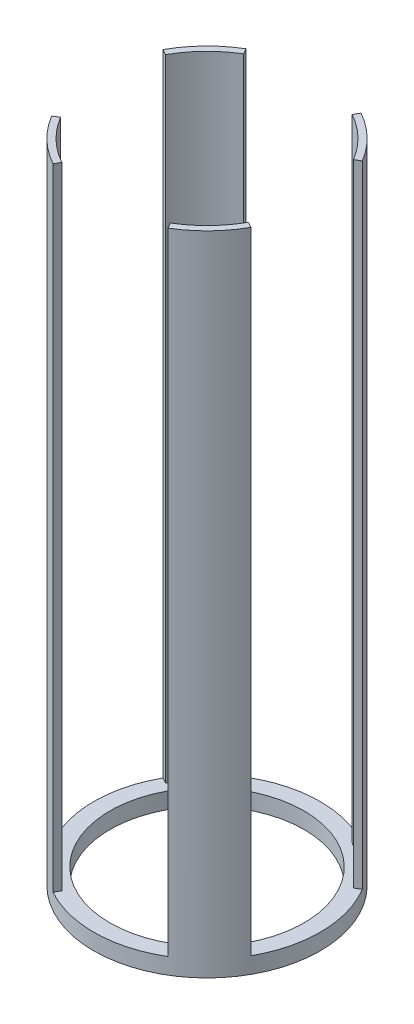
ISO-10303-21;
HEADER;
FILE_DESCRIPTION(('STEP AP214'),'2;1');
FILE_NAME('part.step','',(''),(''),'','','');
FILE_SCHEMA(('AUTOMOTIVE_DESIGN { 1 0 10303 214 1 1 1 1 }'));
ENDSEC;
DATA;
#1=APPLICATION_CONTEXT('core data for automotive mechanical design processes');
#2=APPLICATION_PROTOCOL_DEFINITION('international standard','automotive_design',2000,#1);
#3=PRODUCT_CONTEXT('',#1,'mechanical');
#4=PRODUCT('Part','Part','',(#3));
#5=PRODUCT_RELATED_PRODUCT_CATEGORY('part','',(#4));
#6=PRODUCT_DEFINITION_FORMATION('','',#4);
#7=PRODUCT_DEFINITION_CONTEXT('part definition',#1,'design');
#8=PRODUCT_DEFINITION('design','',#6,#7);
#9=PRODUCT_DEFINITION_SHAPE('','',#8);
#10=(LENGTH_UNIT() NAMED_UNIT(*) SI_UNIT(.MILLI.,.METRE.));
#11=(NAMED_UNIT(*) PLANE_ANGLE_UNIT() SI_UNIT($,.RADIAN.));
#12=(NAMED_UNIT(*) SI_UNIT($,.STERADIAN.) SOLID_ANGLE_UNIT());
#13=UNCERTAINTY_MEASURE_WITH_UNIT(LENGTH_MEASURE(1.E-05),#10,'distance_accuracy_value','');
#14=(GEOMETRIC_REPRESENTATION_CONTEXT(3) GLOBAL_UNCERTAINTY_ASSIGNED_CONTEXT((#13)) GLOBAL_UNIT_ASSIGNED_CONTEXT((#10,
#11,#12)) REPRESENTATION_CONTEXT('',''));
#15=CARTESIAN_POINT('',(0.,0.,0.));
#16=DIRECTION('',(0.,0.,1.));
#17=DIRECTION('',(1.,0.,0.));
#18=AXIS2_PLACEMENT_3D('',#15,#16,#17);
#19=CARTESIAN_POINT('',(0.,-241.3,0.));
#20=DIRECTION('',(0.,-1.,0.));
#21=DIRECTION('',(0.,0.,-1.));
#22=AXIS2_PLACEMENT_3D('',#19,#20,#21);
#23=PLANE('',#22);
#24=CARTESIAN_POINT('',(0.,-241.3,0.));
#25=DIRECTION('',(0.,-1.,0.));
#26=DIRECTION('',(0.,0.,-1.));
#27=AXIS2_PLACEMENT_3D('',#24,#25,#26);
#28=CIRCLE('',#27,76.2);
#29=CARTESIAN_POINT('',(0.,-241.3,-76.2));
#30=VERTEX_POINT('',#29);
#31=EDGE_CURVE('E415',#30,#30,#28,.T.);
#32=ORIENTED_EDGE('',*,*,#31,.T.);
#33=EDGE_LOOP('',(#32));
#34=FACE_BOUND('',#33,.T.);
#35=CARTESIAN_POINT('',(0.,-241.3,0.));
#36=DIRECTION('',(0.,-1.,0.));
#37=DIRECTION('',(0.,0.,-1.));
#38=AXIS2_PLACEMENT_3D('',#35,#36,#37);
#39=CIRCLE('',#38,83.82);
#40=CARTESIAN_POINT('',(43.0878052929432,-241.3,71.8973812808048));
#41=VERTEX_POINT('',#40);
#42=CARTESIAN_POINT('',(73.2638246174091,-241.3,40.7210560082805));
#43=VERTEX_POINT('',#42);
#44=EDGE_CURVE('E364',#41,#43,#39,.F.);
#45=ORIENTED_EDGE('',*,*,#44,.T.);
#46=DIRECTION('',(0.87406137696742,0.,0.485815509523748));
#47=VECTOR('',#46,1.);
#48=CARTESIAN_POINT('',(0.,-241.3,0.));
#49=LINE('',#48,#47);
#50=CARTESIAN_POINT('',(77.7040564124036,-241.3,43.1889987966612));
#51=VERTEX_POINT('',#50);
#52=EDGE_CURVE('E361',#43,#51,#49,.T.);
#53=ORIENTED_EDGE('',*,*,#52,.T.);
#54=CARTESIAN_POINT('',(0.,-241.3,0.));
#55=DIRECTION('',(0.,-1.,0.));
#56=DIRECTION('',(0.,0.,-1.));
#57=AXIS2_PLACEMENT_3D('',#54,#55,#56);
#58=CIRCLE('',#57,88.9);
#59=CARTESIAN_POINT('',(76.2547983281261,-241.3,-45.6991874319097));
#60=VERTEX_POINT('',#59);
#61=EDGE_CURVE('E491',#60,#51,#58,.T.);
#62=ORIENTED_EDGE('',*,*,#61,.F.);
#63=DIRECTION('',(-0.857759261283759,0.,0.514051602158714));
#64=VECTOR('',#63,1.);
#65=CARTESIAN_POINT('',(0.,-241.3,0.));
#66=LINE('',#65,#64);
#67=CARTESIAN_POINT('',(71.8973812808046,-241.3,-43.0878052929434));
#68=VERTEX_POINT('',#67);
#69=EDGE_CURVE('E241',#60,#68,#66,.T.);
#70=ORIENTED_EDGE('',*,*,#69,.T.);
#71=CARTESIAN_POINT('',(0.,-241.3,0.));
#72=DIRECTION('',(0.,-1.,0.));
#73=DIRECTION('',(0.,0.,-1.));
#74=AXIS2_PLACEMENT_3D('',#71,#72,#73);
#75=CIRCLE('',#74,83.82);
#76=CARTESIAN_POINT('',(40.7210560082808,-241.3,-73.2638246174089));
#77=VERTEX_POINT('',#76);
#78=EDGE_CURVE('E391',#68,#77,#75,.F.);
#79=ORIENTED_EDGE('',*,*,#78,.T.);
#80=DIRECTION('',(-0.485815509523751,0.,0.874061376967418));
#81=VECTOR('',#80,1.);
#82=CARTESIAN_POINT('',(0.,-241.3,0.));
#83=LINE('',#82,#81);
#84=CARTESIAN_POINT('',(43.1889987966615,-241.3,-77.7040564124034));
#85=VERTEX_POINT('',#84);
#86=EDGE_CURVE('E383',#85,#77,#83,.T.);
#87=ORIENTED_EDGE('',*,*,#86,.F.);
#88=CARTESIAN_POINT('',(-45.6991874319094,-241.3,-76.2547983281263));
#89=VERTEX_POINT('',#88);
#90=EDGE_CURVE('E425',#89,#85,#58,.T.);
#91=ORIENTED_EDGE('',*,*,#90,.F.);
#92=DIRECTION('',(-0.514051602158711,0.,-0.85775926128376));
#93=VECTOR('',#92,1.);
#94=CARTESIAN_POINT('',(0.,-241.3,0.));
#95=LINE('',#94,#93);
#96=CARTESIAN_POINT('',(-43.0878052929431,-241.3,-71.8973812808048));
#97=VERTEX_POINT('',#96);
#98=EDGE_CURVE('E12',#97,#89,#95,.T.);
#99=ORIENTED_EDGE('',*,*,#98,.F.);
#100=CARTESIAN_POINT('',(0.,-241.3,0.));
#101=DIRECTION('',(0.,-1.,0.));
#102=DIRECTION('',(0.,0.,-1.));
#103=AXIS2_PLACEMENT_3D('',#100,#101,#102);
#104=CIRCLE('',#103,83.82);
#105=CARTESIAN_POINT('',(-73.2638246174091,-241.3,-40.7210560082805));
#106=VERTEX_POINT('',#105);
#107=EDGE_CURVE('E226',#97,#106,#104,.F.);
#108=ORIENTED_EDGE('',*,*,#107,.T.);
#109=DIRECTION('',(0.87406137696742,0.,0.485815509523748));
#110=VECTOR('',#109,1.);
#111=CARTESIAN_POINT('',(0.,-241.3,0.));
#112=LINE('',#111,#110);
#113=CARTESIAN_POINT('',(-77.7040564124036,-241.3,-43.1889987966612));
#114=VERTEX_POINT('',#113);
#115=EDGE_CURVE('E458',#114,#106,#112,.T.);
#116=ORIENTED_EDGE('',*,*,#115,.F.);
#117=CARTESIAN_POINT('',(-76.2547983281261,-241.3,45.6991874319097));
#118=VERTEX_POINT('',#117);
#119=EDGE_CURVE('E421',#118,#114,#58,.T.);
#120=ORIENTED_EDGE('',*,*,#119,.F.);
#121=DIRECTION('',(0.857759261283758,0.,-0.514051602158714));
#122=VECTOR('',#121,1.);
#123=CARTESIAN_POINT('',(0.,-241.3,0.));
#124=LINE('',#123,#122);
#125=CARTESIAN_POINT('',(-71.8973812808046,-241.3,43.0878052929434));
#126=VERTEX_POINT('',#125);
#127=EDGE_CURVE('E427',#118,#126,#124,.T.);
#128=ORIENTED_EDGE('',*,*,#127,.T.);
#129=CARTESIAN_POINT('',(0.,-241.3,0.));
#130=DIRECTION('',(0.,-1.,0.));
#131=DIRECTION('',(0.,0.,-1.));
#132=AXIS2_PLACEMENT_3D('',#129,#130,#131);
#133=CIRCLE('',#132,83.82);
#134=CARTESIAN_POINT('',(-40.7210560082808,-241.3,73.263824617409));
#135=VERTEX_POINT('',#134);
#136=EDGE_CURVE('E424',#135,#126,#133,.T.);
#137=ORIENTED_EDGE('',*,*,#136,.F.);
#138=DIRECTION('',(0.48581550952375,0.,-0.874061376967418));
#139=VECTOR('',#138,1.);
#140=CARTESIAN_POINT('',(0.,-241.3,0.));
#141=LINE('',#140,#139);
#142=CARTESIAN_POINT('',(-43.1889987966614,-241.3,77.7040564124034));
#143=VERTEX_POINT('',#142);
#144=EDGE_CURVE('E448',#143,#135,#141,.T.);
#145=ORIENTED_EDGE('',*,*,#144,.F.);
#146=CARTESIAN_POINT('',(45.6991874319094,-241.3,76.2547983281263));
#147=VERTEX_POINT('',#146);
#148=EDGE_CURVE('E418',#147,#143,#58,.T.);
#149=ORIENTED_EDGE('',*,*,#148,.F.);
#150=DIRECTION('',(-0.514051602158711,0.,-0.85775926128376));
#151=VECTOR('',#150,1.);
#152=CARTESIAN_POINT('',(0.,-241.3,0.));
#153=LINE('',#152,#151);
#154=EDGE_CURVE('E335',#147,#41,#153,.T.);
#155=ORIENTED_EDGE('',*,*,#154,.T.);
#156=EDGE_LOOP('',(#45,#53,#62,#70,#79,#87,#91,#99,#108,#116,#120,#128,#137,#145,#149,#155));
#157=FACE_BOUND('',#156,.T.);
#158=ADVANCED_FACE('F218',(#34,#157),#23,.F.);
#159=CARTESIAN_POINT('',(0.,254.,0.));
#160=DIRECTION('',(0.,-1.,0.));
#161=DIRECTION('',(0.,0.,-1.));
#162=AXIS2_PLACEMENT_3D('',#159,#160,#161);
#163=CYLINDRICAL_SURFACE('',#162,83.82);
#164=DIRECTION('',(0.,-1.,0.));
#165=VECTOR('',#164,1.);
#166=CARTESIAN_POINT('',(-40.7210560082808,254.,73.263824617409));
#167=LINE('',#166,#165);
#168=CARTESIAN_POINT('',(-40.7210560082808,254.,73.263824617409));
#169=VERTEX_POINT('',#168);
#170=EDGE_CURVE('E431',#169,#135,#167,.T.);
#171=ORIENTED_EDGE('',*,*,#170,.T.);
#172=ORIENTED_EDGE('',*,*,#136,.T.);
#173=DIRECTION('',(0.,-1.,0.));
#174=VECTOR('',#173,1.);
#175=CARTESIAN_POINT('',(-71.8973812808046,254.,43.0878052929434));
#176=LINE('',#175,#174);
#177=CARTESIAN_POINT('',(-71.8973812808046,254.,43.0878052929434));
#178=VERTEX_POINT('',#177);
#179=EDGE_CURVE('E434',#178,#126,#176,.T.);
#180=ORIENTED_EDGE('',*,*,#179,.F.);
#181=CARTESIAN_POINT('',(0.,254.,0.));
#182=DIRECTION('',(0.,1.,0.));
#183=DIRECTION('',(0.,0.,1.));
#184=AXIS2_PLACEMENT_3D('',#181,#182,#183);
#185=CIRCLE('',#184,83.82);
#186=EDGE_CURVE('E435',#178,#169,#185,.T.);
#187=ORIENTED_EDGE('',*,*,#186,.T.);
#188=EDGE_LOOP('',(#171,#172,#180,#187));
#189=FACE_BOUND('',#188,.T.);
#190=ADVANCED_FACE('F485',(#189),#163,.F.);
#191=CARTESIAN_POINT('',(0.,-254.,0.));
#192=DIRECTION('',(0.514051602158714,0.,0.857759261283758));
#193=DIRECTION('',(0.857759261283758,0.,-0.514051602158714));
#194=AXIS2_PLACEMENT_3D('',#191,#192,#193);
#195=PLANE('',#194);
#196=ORIENTED_EDGE('',*,*,#127,.F.);
#197=DIRECTION('',(0.,-1.,0.));
#198=VECTOR('',#197,1.);
#199=CARTESIAN_POINT('',(-76.2547983281261,254.,45.6991874319097));
#200=LINE('',#199,#198);
#201=CARTESIAN_POINT('',(-76.2547983281261,254.,45.6991874319097));
#202=VERTEX_POINT('',#201);
#203=EDGE_CURVE('E441',#202,#118,#200,.T.);
#204=ORIENTED_EDGE('',*,*,#203,.F.);
#205=DIRECTION('',(0.857759261283758,0.,-0.514051602158714));
#206=VECTOR('',#205,1.);
#207=CARTESIAN_POINT('',(0.,254.,0.));
#208=LINE('',#207,#206);
#209=EDGE_CURVE('E436',#202,#178,#208,.T.);
#210=ORIENTED_EDGE('',*,*,#209,.T.);
#211=ORIENTED_EDGE('',*,*,#179,.T.);
#212=EDGE_LOOP('',(#196,#204,#210,#211));
#213=FACE_BOUND('',#212,.T.);
#214=ADVANCED_FACE('F480',(#213),#195,.F.);
#215=CARTESIAN_POINT('',(0.,-254.,0.));
#216=DIRECTION('',(0.874061376967418,0.,0.48581550952375));
#217=DIRECTION('',(0.48581550952375,0.,-0.874061376967418));
#218=AXIS2_PLACEMENT_3D('',#215,#216,#217);
#219=PLANE('',#218);
#220=DIRECTION('',(0.,-1.,0.));
#221=VECTOR('',#220,1.);
#222=CARTESIAN_POINT('',(-43.1889987966614,254.,77.7040564124034));
#223=LINE('',#222,#221);
#224=CARTESIAN_POINT('',(-43.1889987966614,254.,77.7040564124034));
#225=VERTEX_POINT('',#224);
#226=EDGE_CURVE('E438',#225,#143,#223,.T.);
#227=ORIENTED_EDGE('',*,*,#226,.T.);
#228=ORIENTED_EDGE('',*,*,#144,.T.);
#229=ORIENTED_EDGE('',*,*,#170,.F.);
#230=DIRECTION('',(0.48581550952375,0.,-0.874061376967418));
#231=VECTOR('',#230,1.);
#232=CARTESIAN_POINT('',(0.,254.,0.));
#233=LINE('',#232,#231);
#234=EDGE_CURVE('E445',#225,#169,#233,.T.);
#235=ORIENTED_EDGE('',*,*,#234,.F.);
#236=EDGE_LOOP('',(#227,#228,#229,#235));
#237=FACE_BOUND('',#236,.T.);
#238=ADVANCED_FACE('F490',(#237),#219,.T.);
#239=CARTESIAN_POINT('',(0.,-254.,0.));
#240=DIRECTION('',(0.,1.,0.));
#241=DIRECTION('',(0.,0.,1.));
#242=AXIS2_PLACEMENT_3D('',#239,#240,#241);
#243=PLANE('',#242);
#244=CARTESIAN_POINT('',(0.,-254.,0.));
#245=DIRECTION('',(0.,1.,0.));
#246=DIRECTION('',(0.,0.,1.));
#247=AXIS2_PLACEMENT_3D('',#244,#245,#246);
#248=CIRCLE('',#247,88.9);
#249=CARTESIAN_POINT('',(0.,-254.,88.9));
#250=VERTEX_POINT('',#249);
#251=EDGE_CURVE('E444',#250,#250,#248,.T.);
#252=ORIENTED_EDGE('',*,*,#251,.F.);
#253=EDGE_LOOP('',(#252));
#254=FACE_BOUND('',#253,.T.);
#255=CARTESIAN_POINT('',(0.,-254.,0.));
#256=DIRECTION('',(0.,-1.,0.));
#257=DIRECTION('',(0.,0.,-1.));
#258=AXIS2_PLACEMENT_3D('',#255,#256,#257);
#259=CIRCLE('',#258,76.2);
#260=CARTESIAN_POINT('',(0.,-254.,-76.2));
#261=VERTEX_POINT('',#260);
#262=EDGE_CURVE('E397',#261,#261,#259,.T.);
#263=ORIENTED_EDGE('',*,*,#262,.F.);
#264=EDGE_LOOP('',(#263));
#265=FACE_BOUND('',#264,.T.);
#266=ADVANCED_FACE('F220',(#254,#265),#243,.F.);
#267=CARTESIAN_POINT('',(0.,254.,0.));
#268=DIRECTION('',(0.,1.,0.));
#269=DIRECTION('',(0.,0.,1.));
#270=AXIS2_PLACEMENT_3D('',#267,#268,#269);
#271=PLANE('',#270);
#272=CARTESIAN_POINT('',(0.,254.,0.));
#273=DIRECTION('',(0.,1.,0.));
#274=DIRECTION('',(0.,0.,1.));
#275=AXIS2_PLACEMENT_3D('',#272,#273,#274);
#276=CIRCLE('',#275,88.9);
#277=EDGE_CURVE('E430',#202,#225,#276,.T.);
#278=ORIENTED_EDGE('',*,*,#277,.T.);
#279=ORIENTED_EDGE('',*,*,#234,.T.);
#280=ORIENTED_EDGE('',*,*,#186,.F.);
#281=ORIENTED_EDGE('',*,*,#209,.F.);
#282=EDGE_LOOP('',(#278,#279,#280,#281));
#283=FACE_BOUND('',#282,.T.);
#284=ADVANCED_FACE('F487',(#283),#271,.T.);
#285=CARTESIAN_POINT('',(0.,254.,0.));
#286=DIRECTION('',(0.,-1.,0.));
#287=DIRECTION('',(0.,0.,-1.));
#288=AXIS2_PLACEMENT_3D('',#285,#286,#287);
#289=CYLINDRICAL_SURFACE('',#288,88.9);
#290=ORIENTED_EDGE('',*,*,#251,.T.);
#291=EDGE_LOOP('',(#290));
#292=FACE_BOUND('',#291,.T.);
#293=ORIENTED_EDGE('',*,*,#61,.T.);
#294=DIRECTION('',(0.,-1.,0.));
#295=VECTOR('',#294,1.);
#296=CARTESIAN_POINT('',(77.7040564124036,254.,43.1889987966612));
#297=LINE('',#296,#295);
#298=CARTESIAN_POINT('',(77.7040564124036,254.,43.1889987966612));
#299=VERTEX_POINT('',#298);
#300=EDGE_CURVE('E351',#299,#51,#297,.T.);
#301=ORIENTED_EDGE('',*,*,#300,.F.);
#302=CARTESIAN_POINT('',(0.,254.,0.));
#303=DIRECTION('',(0.,1.,0.));
#304=DIRECTION('',(0.,0.,1.));
#305=AXIS2_PLACEMENT_3D('',#302,#303,#304);
#306=CIRCLE('',#305,88.9);
#307=CARTESIAN_POINT('',(45.6991874319095,254.,76.2547983281263));
#308=VERTEX_POINT('',#307);
#309=EDGE_CURVE('E344',#308,#299,#306,.T.);
#310=ORIENTED_EDGE('',*,*,#309,.F.);
#311=DIRECTION('',(0.,-1.,0.));
#312=VECTOR('',#311,1.);
#313=CARTESIAN_POINT('',(45.6991874319094,254.,76.2547983281263));
#314=LINE('',#313,#312);
#315=EDGE_CURVE('E329',#147,#308,#314,.F.);
#316=ORIENTED_EDGE('',*,*,#315,.F.);
#317=ORIENTED_EDGE('',*,*,#148,.T.);
#318=ORIENTED_EDGE('',*,*,#226,.F.);
#319=ORIENTED_EDGE('',*,*,#277,.F.);
#320=ORIENTED_EDGE('',*,*,#203,.T.);
#321=ORIENTED_EDGE('',*,*,#119,.T.);
#322=DIRECTION('',(0.,-1.,0.));
#323=VECTOR('',#322,1.);
#324=CARTESIAN_POINT('',(-77.7040564124036,254.,-43.1889987966611));
#325=LINE('',#324,#323);
#326=CARTESIAN_POINT('',(-77.7040564124036,254.,-43.1889987966612));
#327=VERTEX_POINT('',#326);
#328=EDGE_CURVE('E407',#114,#327,#325,.F.);
#329=ORIENTED_EDGE('',*,*,#328,.T.);
#330=CARTESIAN_POINT('',(0.,254.,0.));
#331=DIRECTION('',(0.,1.,0.));
#332=DIRECTION('',(0.,0.,1.));
#333=AXIS2_PLACEMENT_3D('',#330,#331,#332);
#334=CIRCLE('',#333,88.9);
#335=CARTESIAN_POINT('',(-45.6991874319094,254.,-76.2547983281263));
#336=VERTEX_POINT('',#335);
#337=EDGE_CURVE('E406',#336,#327,#334,.T.);
#338=ORIENTED_EDGE('',*,*,#337,.F.);
#339=DIRECTION('',(0.,-1.,0.));
#340=VECTOR('',#339,1.);
#341=CARTESIAN_POINT('',(-45.6991874319094,254.,-76.2547983281263));
#342=LINE('',#341,#340);
#343=EDGE_CURVE('E403',#336,#89,#342,.T.);
#344=ORIENTED_EDGE('',*,*,#343,.T.);
#345=ORIENTED_EDGE('',*,*,#90,.T.);
#346=DIRECTION('',(0.,-1.,0.));
#347=VECTOR('',#346,1.);
#348=CARTESIAN_POINT('',(43.1889987966614,254.,-77.7040564124034));
#349=LINE('',#348,#347);
#350=CARTESIAN_POINT('',(43.1889987966614,254.,-77.7040564124034));
#351=VERTEX_POINT('',#350);
#352=EDGE_CURVE('E375',#85,#351,#349,.F.);
#353=ORIENTED_EDGE('',*,*,#352,.T.);
#354=CARTESIAN_POINT('',(0.,254.,0.));
#355=DIRECTION('',(0.,1.,0.));
#356=DIRECTION('',(0.,0.,1.));
#357=AXIS2_PLACEMENT_3D('',#354,#355,#356);
#358=CIRCLE('',#357,88.9);
#359=CARTESIAN_POINT('',(76.2547983281261,254.,-45.6991874319097));
#360=VERTEX_POINT('',#359);
#361=EDGE_CURVE('E379',#360,#351,#358,.T.);
#362=ORIENTED_EDGE('',*,*,#361,.F.);
#363=DIRECTION('',(0.,-1.,0.));
#364=VECTOR('',#363,1.);
#365=CARTESIAN_POINT('',(76.2547983281261,254.,-45.6991874319097));
#366=LINE('',#365,#364);
#367=EDGE_CURVE('E371',#60,#360,#366,.F.);
#368=ORIENTED_EDGE('',*,*,#367,.F.);
#369=EDGE_LOOP('',(#293,#301,#310,#316,#317,#318,#319,#320,#321,#329,#338,#344,#345,#353,#362,#368));
#370=FACE_BOUND('',#369,.T.);
#371=ADVANCED_FACE('F350',(#292,#370),#289,.T.);
#372=CARTESIAN_POINT('',(0.,-241.3,0.));
#373=DIRECTION('',(0.,-1.,0.));
#374=DIRECTION('',(0.,0.,-1.));
#375=AXIS2_PLACEMENT_3D('',#372,#373,#374);
#376=CYLINDRICAL_SURFACE('',#375,76.2);
#377=ORIENTED_EDGE('',*,*,#31,.F.);
#378=EDGE_LOOP('',(#377));
#379=FACE_BOUND('',#378,.T.);
#380=ORIENTED_EDGE('',*,*,#262,.T.);
#381=EDGE_LOOP('',(#380));
#382=FACE_BOUND('',#381,.T.);
#383=ADVANCED_FACE('F527',(#379,#382),#376,.F.);
#384=CARTESIAN_POINT('',(0.,254.,0.));
#385=DIRECTION('',(0.,-1.,0.));
#386=DIRECTION('',(0.,0.,-1.));
#387=AXIS2_PLACEMENT_3D('',#384,#385,#386);
#388=CYLINDRICAL_SURFACE('',#387,83.82);
#389=ORIENTED_EDGE('',*,*,#107,.F.);
#390=DIRECTION('',(0.,-1.,0.));
#391=VECTOR('',#390,1.);
#392=CARTESIAN_POINT('',(-43.0878052929431,254.,-71.8973812808048));
#393=LINE('',#392,#391);
#394=CARTESIAN_POINT('',(-43.0878052929431,254.,-71.8973812808048));
#395=VERTEX_POINT('',#394);
#396=EDGE_CURVE('E399',#395,#97,#393,.T.);
#397=ORIENTED_EDGE('',*,*,#396,.F.);
#398=CARTESIAN_POINT('',(0.,254.,0.));
#399=DIRECTION('',(0.,1.,0.));
#400=DIRECTION('',(0.,0.,1.));
#401=AXIS2_PLACEMENT_3D('',#398,#399,#400);
#402=CIRCLE('',#401,83.82);
#403=CARTESIAN_POINT('',(-73.2638246174091,254.,-40.7210560082805));
#404=VERTEX_POINT('',#403);
#405=EDGE_CURVE('E393',#395,#404,#402,.T.);
#406=ORIENTED_EDGE('',*,*,#405,.T.);
#407=DIRECTION('',(0.,-1.,0.));
#408=VECTOR('',#407,1.);
#409=CARTESIAN_POINT('',(-73.2638246174091,254.,-40.7210560082805));
#410=LINE('',#409,#408);
#411=EDGE_CURVE('E398',#106,#404,#410,.F.);
#412=ORIENTED_EDGE('',*,*,#411,.F.);
#413=EDGE_LOOP('',(#389,#397,#406,#412));
#414=FACE_BOUND('',#413,.T.);
#415=ADVANCED_FACE('F469',(#414),#388,.F.);
#416=CARTESIAN_POINT('',(0.,-254.,0.));
#417=DIRECTION('',(-0.85775926128376,0.,0.514051602158711));
#418=DIRECTION('',(0.514051602158711,0.,0.85775926128376));
#419=AXIS2_PLACEMENT_3D('',#416,#417,#418);
#420=PLANE('',#419);
#421=ORIENTED_EDGE('',*,*,#396,.T.);
#422=ORIENTED_EDGE('',*,*,#98,.T.);
#423=ORIENTED_EDGE('',*,*,#343,.F.);
#424=DIRECTION('',(0.514051602158711,0.,0.85775926128376));
#425=VECTOR('',#424,1.);
#426=CARTESIAN_POINT('',(0.,254.,0.));
#427=LINE('',#426,#425);
#428=EDGE_CURVE('E402',#336,#395,#427,.T.);
#429=ORIENTED_EDGE('',*,*,#428,.T.);
#430=EDGE_LOOP('',(#421,#422,#423,#429));
#431=FACE_BOUND('',#430,.T.);
#432=ADVANCED_FACE('F551',(#431),#420,.F.);
#433=CARTESIAN_POINT('',(0.,-254.,0.));
#434=DIRECTION('',(0.485815509523747,0.,-0.87406137696742));
#435=DIRECTION('',(-0.87406137696742,0.,-0.485815509523748));
#436=AXIS2_PLACEMENT_3D('',#433,#434,#435);
#437=PLANE('',#436);
#438=ORIENTED_EDGE('',*,*,#328,.F.);
#439=ORIENTED_EDGE('',*,*,#115,.T.);
#440=ORIENTED_EDGE('',*,*,#411,.T.);
#441=DIRECTION('',(-0.87406137696742,0.,-0.485815509523748));
#442=VECTOR('',#441,1.);
#443=CARTESIAN_POINT('',(0.,254.,0.));
#444=LINE('',#443,#442);
#445=EDGE_CURVE('E394',#404,#327,#444,.T.);
#446=ORIENTED_EDGE('',*,*,#445,.T.);
#447=EDGE_LOOP('',(#438,#439,#440,#446));
#448=FACE_BOUND('',#447,.T.);
#449=ADVANCED_FACE('F467',(#448),#437,.F.);
#450=CARTESIAN_POINT('',(0.,254.,0.));
#451=DIRECTION('',(0.,1.,0.));
#452=DIRECTION('',(0.,0.,1.));
#453=AXIS2_PLACEMENT_3D('',#450,#451,#452);
#454=PLANE('',#453);
#455=ORIENTED_EDGE('',*,*,#445,.F.);
#456=ORIENTED_EDGE('',*,*,#405,.F.);
#457=ORIENTED_EDGE('',*,*,#428,.F.);
#458=ORIENTED_EDGE('',*,*,#337,.T.);
#459=EDGE_LOOP('',(#455,#456,#457,#458));
#460=FACE_BOUND('',#459,.T.);
#461=ADVANCED_FACE('F473',(#460),#454,.T.);
#462=CARTESIAN_POINT('',(0.,254.,0.));
#463=DIRECTION('',(0.,-1.,0.));
#464=DIRECTION('',(0.,0.,-1.));
#465=AXIS2_PLACEMENT_3D('',#462,#463,#464);
#466=CYLINDRICAL_SURFACE('',#465,83.82);
#467=ORIENTED_EDGE('',*,*,#78,.F.);
#468=DIRECTION('',(0.,-1.,0.));
#469=VECTOR('',#468,1.);
#470=CARTESIAN_POINT('',(71.8973812808046,254.,-43.0878052929434));
#471=LINE('',#470,#469);
#472=CARTESIAN_POINT('',(71.8973812808046,254.,-43.0878052929434));
#473=VERTEX_POINT('',#472);
#474=EDGE_CURVE('E372',#68,#473,#471,.F.);
#475=ORIENTED_EDGE('',*,*,#474,.T.);
#476=CARTESIAN_POINT('',(0.,254.,0.));
#477=DIRECTION('',(0.,1.,0.));
#478=DIRECTION('',(0.,0.,1.));
#479=AXIS2_PLACEMENT_3D('',#476,#477,#478);
#480=CIRCLE('',#479,83.82);
#481=CARTESIAN_POINT('',(40.7210560082808,254.,-73.2638246174089));
#482=VERTEX_POINT('',#481);
#483=EDGE_CURVE('E374',#473,#482,#480,.T.);
#484=ORIENTED_EDGE('',*,*,#483,.T.);
#485=DIRECTION('',(0.,-1.,0.));
#486=VECTOR('',#485,1.);
#487=CARTESIAN_POINT('',(40.7210560082808,254.,-73.2638246174089));
#488=LINE('',#487,#486);
#489=EDGE_CURVE('E368',#77,#482,#488,.F.);
#490=ORIENTED_EDGE('',*,*,#489,.F.);
#491=EDGE_LOOP('',(#467,#475,#484,#490));
#492=FACE_BOUND('',#491,.T.);
#493=ADVANCED_FACE('F507',(#492),#466,.F.);
#494=CARTESIAN_POINT('',(0.,-254.,0.));
#495=DIRECTION('',(0.514051602158714,0.,0.857759261283759));
#496=DIRECTION('',(0.857759261283759,0.,-0.514051602158714));
#497=AXIS2_PLACEMENT_3D('',#494,#495,#496);
#498=PLANE('',#497);
#499=ORIENTED_EDGE('',*,*,#69,.F.);
#500=ORIENTED_EDGE('',*,*,#367,.T.);
#501=DIRECTION('',(0.857759261283759,0.,-0.514051602158714));
#502=VECTOR('',#501,1.);
#503=CARTESIAN_POINT('',(0.,254.,0.));
#504=LINE('',#503,#502);
#505=EDGE_CURVE('E367',#473,#360,#504,.T.);
#506=ORIENTED_EDGE('',*,*,#505,.F.);
#507=ORIENTED_EDGE('',*,*,#474,.F.);
#508=EDGE_LOOP('',(#499,#500,#506,#507));
#509=FACE_BOUND('',#508,.T.);
#510=ADVANCED_FACE('F504',(#509),#498,.T.);
#511=CARTESIAN_POINT('',(0.,-254.,0.));
#512=DIRECTION('',(0.874061376967418,0.,0.485815509523751));
#513=DIRECTION('',(0.485815509523751,0.,-0.874061376967418));
#514=AXIS2_PLACEMENT_3D('',#511,#512,#513);
#515=PLANE('',#514);
#516=ORIENTED_EDGE('',*,*,#352,.F.);
#517=ORIENTED_EDGE('',*,*,#86,.T.);
#518=ORIENTED_EDGE('',*,*,#489,.T.);
#519=DIRECTION('',(0.485815509523751,0.,-0.874061376967418));
#520=VECTOR('',#519,1.);
#521=CARTESIAN_POINT('',(0.,254.,0.));
#522=LINE('',#521,#520);
#523=EDGE_CURVE('E370',#482,#351,#522,.T.);
#524=ORIENTED_EDGE('',*,*,#523,.T.);
#525=EDGE_LOOP('',(#516,#517,#518,#524));
#526=FACE_BOUND('',#525,.T.);
#527=ADVANCED_FACE('F496',(#526),#515,.F.);
#528=CARTESIAN_POINT('',(0.,254.,0.));
#529=DIRECTION('',(0.,1.,0.));
#530=DIRECTION('',(0.,0.,1.));
#531=AXIS2_PLACEMENT_3D('',#528,#529,#530);
#532=PLANE('',#531);
#533=ORIENTED_EDGE('',*,*,#523,.F.);
#534=ORIENTED_EDGE('',*,*,#483,.F.);
#535=ORIENTED_EDGE('',*,*,#505,.T.);
#536=ORIENTED_EDGE('',*,*,#361,.T.);
#537=EDGE_LOOP('',(#533,#534,#535,#536));
#538=FACE_BOUND('',#537,.T.);
#539=ADVANCED_FACE('F501',(#538),#532,.T.);
#540=CARTESIAN_POINT('',(0.,254.,0.));
#541=DIRECTION('',(0.,-1.,0.));
#542=DIRECTION('',(0.,0.,-1.));
#543=AXIS2_PLACEMENT_3D('',#540,#541,#542);
#544=CYLINDRICAL_SURFACE('',#543,83.82);
#545=ORIENTED_EDGE('',*,*,#44,.F.);
#546=DIRECTION('',(0.,-1.,0.));
#547=VECTOR('',#546,1.);
#548=CARTESIAN_POINT('',(43.0878052929432,254.,71.8973812808048));
#549=LINE('',#548,#547);
#550=CARTESIAN_POINT('',(43.0878052929432,254.,71.8973812808048));
#551=VERTEX_POINT('',#550);
#552=EDGE_CURVE('E233',#41,#551,#549,.F.);
#553=ORIENTED_EDGE('',*,*,#552,.T.);
#554=CARTESIAN_POINT('',(0.,254.,0.));
#555=DIRECTION('',(0.,1.,0.));
#556=DIRECTION('',(0.,0.,1.));
#557=AXIS2_PLACEMENT_3D('',#554,#555,#556);
#558=CIRCLE('',#557,83.82);
#559=CARTESIAN_POINT('',(73.2638246174091,254.,40.7210560082805));
#560=VERTEX_POINT('',#559);
#561=EDGE_CURVE('E346',#551,#560,#558,.T.);
#562=ORIENTED_EDGE('',*,*,#561,.T.);
#563=DIRECTION('',(0.,-1.,0.));
#564=VECTOR('',#563,1.);
#565=CARTESIAN_POINT('',(73.2638246174091,254.,40.7210560082805));
#566=LINE('',#565,#564);
#567=EDGE_CURVE('E352',#560,#43,#566,.T.);
#568=ORIENTED_EDGE('',*,*,#567,.T.);
#569=EDGE_LOOP('',(#545,#553,#562,#568));
#570=FACE_BOUND('',#569,.T.);
#571=ADVANCED_FACE('F561',(#570),#544,.F.);
#572=CARTESIAN_POINT('',(0.,-254.,0.));
#573=DIRECTION('',(0.485815509523748,0.,-0.87406137696742));
#574=DIRECTION('',(-0.87406137696742,0.,-0.485815509523748));
#575=AXIS2_PLACEMENT_3D('',#572,#573,#574);
#576=PLANE('',#575);
#577=ORIENTED_EDGE('',*,*,#52,.F.);
#578=ORIENTED_EDGE('',*,*,#567,.F.);
#579=DIRECTION('',(-0.87406137696742,0.,-0.485815509523748));
#580=VECTOR('',#579,1.);
#581=CARTESIAN_POINT('',(0.,254.,0.));
#582=LINE('',#581,#580);
#583=EDGE_CURVE('E339',#299,#560,#582,.T.);
#584=ORIENTED_EDGE('',*,*,#583,.F.);
#585=ORIENTED_EDGE('',*,*,#300,.T.);
#586=EDGE_LOOP('',(#577,#578,#584,#585));
#587=FACE_BOUND('',#586,.T.);
#588=ADVANCED_FACE('F566',(#587),#576,.T.);
#589=CARTESIAN_POINT('',(0.,-254.,0.));
#590=DIRECTION('',(-0.85775926128376,0.,0.514051602158711));
#591=DIRECTION('',(0.514051602158711,0.,0.85775926128376));
#592=AXIS2_PLACEMENT_3D('',#589,#590,#591);
#593=PLANE('',#592);
#594=ORIENTED_EDGE('',*,*,#154,.F.);
#595=ORIENTED_EDGE('',*,*,#315,.T.);
#596=DIRECTION('',(0.514051602158711,0.,0.85775926128376));
#597=VECTOR('',#596,1.);
#598=CARTESIAN_POINT('',(0.,254.,0.));
#599=LINE('',#598,#597);
#600=EDGE_CURVE('E332',#551,#308,#599,.T.);
#601=ORIENTED_EDGE('',*,*,#600,.F.);
#602=ORIENTED_EDGE('',*,*,#552,.F.);
#603=EDGE_LOOP('',(#594,#595,#601,#602));
#604=FACE_BOUND('',#603,.T.);
#605=ADVANCED_FACE('F331',(#604),#593,.T.);
#606=CARTESIAN_POINT('',(0.,254.,0.));
#607=DIRECTION('',(0.,1.,0.));
#608=DIRECTION('',(0.,0.,1.));
#609=AXIS2_PLACEMENT_3D('',#606,#607,#608);
#610=PLANE('',#609);
#611=ORIENTED_EDGE('',*,*,#561,.F.);
#612=ORIENTED_EDGE('',*,*,#600,.T.);
#613=ORIENTED_EDGE('',*,*,#309,.T.);
#614=ORIENTED_EDGE('',*,*,#583,.T.);
#615=EDGE_LOOP('',(#611,#612,#613,#614));
#616=FACE_BOUND('',#615,.T.);
#617=ADVANCED_FACE('F342',(#616),#610,.T.);
#618=CLOSED_SHELL('',(#158,#190,#214,#238,#266,#284,#371,#383,#415,#432,#449,#461,#493,#510,
#527,#539,#571,#588,#605,#617));
#619=MANIFOLD_SOLID_BREP('B2',#618);
#620=ADVANCED_BREP_SHAPE_REPRESENTATION('',(#18,#619),#14);
#621=SHAPE_DEFINITION_REPRESENTATION(#9,#620);
ENDSEC;
END-ISO-10303-21;
